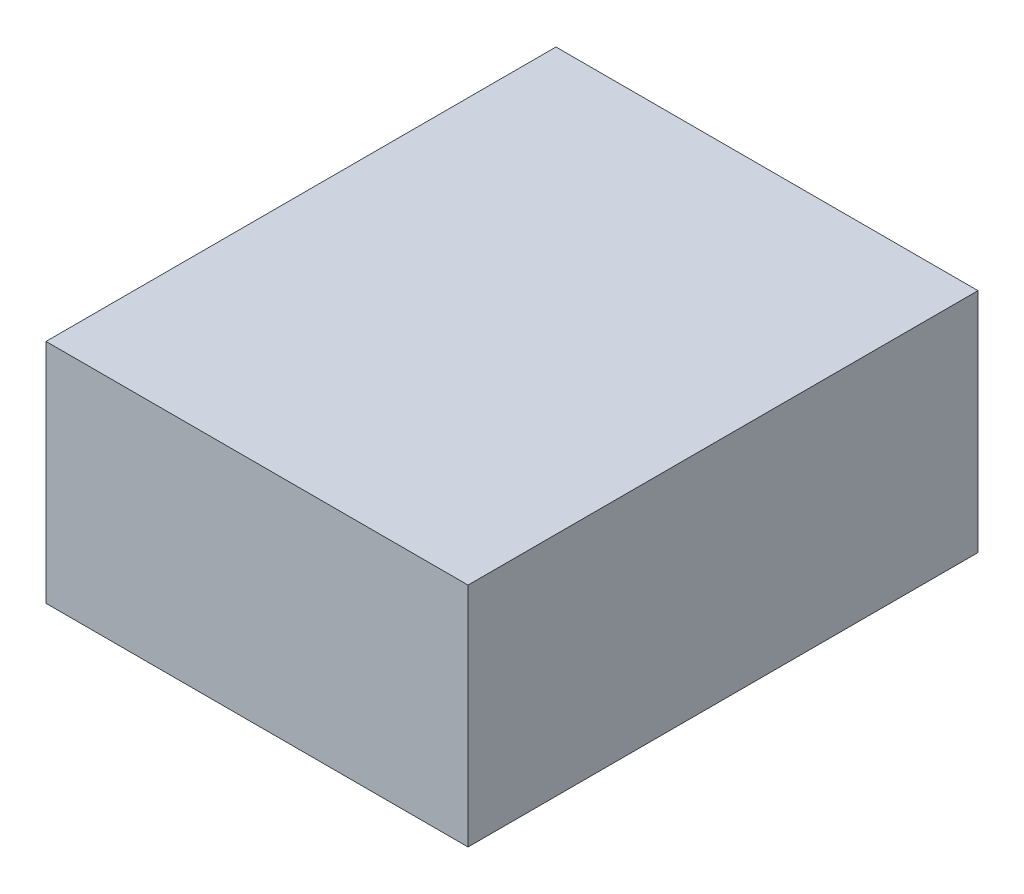
ISO-10303-21;
HEADER;
FILE_DESCRIPTION(('STEP AP214'),'2;1');
FILE_NAME('part.step','',(''),(''),'','','');
FILE_SCHEMA(('AUTOMOTIVE_DESIGN { 1 0 10303 214 1 1 1 1 }'));
ENDSEC;
DATA;
#1=APPLICATION_CONTEXT('core data for automotive mechanical design processes');
#2=APPLICATION_PROTOCOL_DEFINITION('international standard','automotive_design',2000,#1);
#3=PRODUCT_CONTEXT('',#1,'mechanical');
#4=PRODUCT('Part','Part','',(#3));
#5=PRODUCT_RELATED_PRODUCT_CATEGORY('part','',(#4));
#6=PRODUCT_DEFINITION_FORMATION('','',#4);
#7=PRODUCT_DEFINITION_CONTEXT('part definition',#1,'design');
#8=PRODUCT_DEFINITION('design','',#6,#7);
#9=PRODUCT_DEFINITION_SHAPE('','',#8);
#10=(LENGTH_UNIT() NAMED_UNIT(*) SI_UNIT(.MILLI.,.METRE.));
#11=(NAMED_UNIT(*) PLANE_ANGLE_UNIT() SI_UNIT($,.RADIAN.));
#12=(NAMED_UNIT(*) SI_UNIT($,.STERADIAN.) SOLID_ANGLE_UNIT());
#13=UNCERTAINTY_MEASURE_WITH_UNIT(LENGTH_MEASURE(1.E-05),#10,'distance_accuracy_value','');
#14=(GEOMETRIC_REPRESENTATION_CONTEXT(3) GLOBAL_UNCERTAINTY_ASSIGNED_CONTEXT((#13)) GLOBAL_UNIT_ASSIGNED_CONTEXT((#10,
#11,#12)) REPRESENTATION_CONTEXT('',''));
#15=CARTESIAN_POINT('',(0.,0.,0.));
#16=DIRECTION('',(0.,0.,1.));
#17=DIRECTION('',(1.,0.,0.));
#18=AXIS2_PLACEMENT_3D('',#15,#16,#17);
#19=CARTESIAN_POINT('',(120.,-64.5,290.));
#20=DIRECTION('',(0.,-1.,0.));
#21=DIRECTION('',(1.,0.,0.));
#22=AXIS2_PLACEMENT_3D('',#19,#20,#21);
#23=PLANE('',#22);
#24=DIRECTION('',(-1.,0.,0.));
#25=VECTOR('',#24,1.);
#26=CARTESIAN_POINT('',(120.,-64.5,0.));
#27=LINE('',#26,#25);
#28=CARTESIAN_POINT('',(120.,-64.5,0.));
#29=VERTEX_POINT('',#28);
#30=CARTESIAN_POINT('',(-120.,-64.5,0.));
#31=VERTEX_POINT('',#30);
#32=EDGE_CURVE('E112',#29,#31,#27,.T.);
#33=ORIENTED_EDGE('',*,*,#32,.F.);
#34=DIRECTION('',(0.,0.,-1.));
#35=VECTOR('',#34,1.);
#36=CARTESIAN_POINT('',(120.,-64.5,290.));
#37=LINE('',#36,#35);
#38=CARTESIAN_POINT('',(120.,-64.5,290.));
#39=VERTEX_POINT('',#38);
#40=EDGE_CURVE('E11',#39,#29,#37,.T.);
#41=ORIENTED_EDGE('',*,*,#40,.F.);
#42=DIRECTION('',(-1.,0.,0.));
#43=VECTOR('',#42,1.);
#44=CARTESIAN_POINT('',(120.,-64.5,290.));
#45=LINE('',#44,#43);
#46=CARTESIAN_POINT('',(-120.,-64.5,290.));
#47=VERTEX_POINT('',#46);
#48=EDGE_CURVE('E105',#39,#47,#45,.T.);
#49=ORIENTED_EDGE('',*,*,#48,.T.);
#50=DIRECTION('',(0.,0.,-1.));
#51=VECTOR('',#50,1.);
#52=CARTESIAN_POINT('',(-120.,-64.5,290.));
#53=LINE('',#52,#51);
#54=EDGE_CURVE('E44',#47,#31,#53,.T.);
#55=ORIENTED_EDGE('',*,*,#54,.T.);
#56=EDGE_LOOP('',(#33,#41,#49,#55));
#57=FACE_BOUND('',#56,.T.);
#58=ADVANCED_FACE('F41',(#57),#23,.T.);
#59=CARTESIAN_POINT('',(120.,-64.5,290.));
#60=DIRECTION('',(-1.,0.,0.));
#61=DIRECTION('',(0.,0.,1.));
#62=AXIS2_PLACEMENT_3D('',#59,#60,#61);
#63=PLANE('',#62);
#64=DIRECTION('',(0.,1.,0.));
#65=VECTOR('',#64,1.);
#66=CARTESIAN_POINT('',(120.,-64.5,0.));
#67=LINE('',#66,#65);
#68=CARTESIAN_POINT('',(120.,64.5,0.));
#69=VERTEX_POINT('',#68);
#70=EDGE_CURVE('E75',#29,#69,#67,.T.);
#71=ORIENTED_EDGE('',*,*,#70,.T.);
#72=DIRECTION('',(0.,0.,-1.));
#73=VECTOR('',#72,1.);
#74=CARTESIAN_POINT('',(120.,64.5,290.));
#75=LINE('',#74,#73);
#76=CARTESIAN_POINT('',(120.,64.5,290.));
#77=VERTEX_POINT('',#76);
#78=EDGE_CURVE('E51',#77,#69,#75,.T.);
#79=ORIENTED_EDGE('',*,*,#78,.F.);
#80=DIRECTION('',(0.,1.,0.));
#81=VECTOR('',#80,1.);
#82=CARTESIAN_POINT('',(120.,-64.5,290.));
#83=LINE('',#82,#81);
#84=EDGE_CURVE('E92',#39,#77,#83,.T.);
#85=ORIENTED_EDGE('',*,*,#84,.F.);
#86=ORIENTED_EDGE('',*,*,#40,.T.);
#87=EDGE_LOOP('',(#71,#79,#85,#86));
#88=FACE_BOUND('',#87,.T.);
#89=ADVANCED_FACE('F128',(#88),#63,.F.);
#90=CARTESIAN_POINT('',(120.,64.5,290.));
#91=DIRECTION('',(0.,-1.,0.));
#92=DIRECTION('',(1.,0.,0.));
#93=AXIS2_PLACEMENT_3D('',#90,#91,#92);
#94=PLANE('',#93);
#95=DIRECTION('',(-1.,0.,0.));
#96=VECTOR('',#95,1.);
#97=CARTESIAN_POINT('',(120.,64.5,0.));
#98=LINE('',#97,#96);
#99=CARTESIAN_POINT('',(-120.,64.5,0.));
#100=VERTEX_POINT('',#99);
#101=EDGE_CURVE('E100',#69,#100,#98,.T.);
#102=ORIENTED_EDGE('',*,*,#101,.T.);
#103=DIRECTION('',(0.,0.,-1.));
#104=VECTOR('',#103,1.);
#105=CARTESIAN_POINT('',(-120.,64.5,290.));
#106=LINE('',#105,#104);
#107=CARTESIAN_POINT('',(-120.,64.5,290.));
#108=VERTEX_POINT('',#107);
#109=EDGE_CURVE('E97',#108,#100,#106,.T.);
#110=ORIENTED_EDGE('',*,*,#109,.F.);
#111=DIRECTION('',(-1.,0.,0.));
#112=VECTOR('',#111,1.);
#113=CARTESIAN_POINT('',(120.,64.5,290.));
#114=LINE('',#113,#112);
#115=EDGE_CURVE('E87',#77,#108,#114,.T.);
#116=ORIENTED_EDGE('',*,*,#115,.F.);
#117=ORIENTED_EDGE('',*,*,#78,.T.);
#118=EDGE_LOOP('',(#102,#110,#116,#117));
#119=FACE_BOUND('',#118,.T.);
#120=ADVANCED_FACE('F98',(#119),#94,.F.);
#121=CARTESIAN_POINT('',(-120.,-64.5,290.));
#122=DIRECTION('',(-1.,0.,0.));
#123=DIRECTION('',(0.,0.,1.));
#124=AXIS2_PLACEMENT_3D('',#121,#122,#123);
#125=PLANE('',#124);
#126=DIRECTION('',(0.,1.,0.));
#127=VECTOR('',#126,1.);
#128=CARTESIAN_POINT('',(-120.,-64.5,0.));
#129=LINE('',#128,#127);
#130=EDGE_CURVE('E116',#31,#100,#129,.T.);
#131=ORIENTED_EDGE('',*,*,#130,.F.);
#132=ORIENTED_EDGE('',*,*,#54,.F.);
#133=DIRECTION('',(0.,1.,0.));
#134=VECTOR('',#133,1.);
#135=CARTESIAN_POINT('',(-120.,-64.5,290.));
#136=LINE('',#135,#134);
#137=EDGE_CURVE('E91',#47,#108,#136,.T.);
#138=ORIENTED_EDGE('',*,*,#137,.T.);
#139=ORIENTED_EDGE('',*,*,#109,.T.);
#140=EDGE_LOOP('',(#131,#132,#138,#139));
#141=FACE_BOUND('',#140,.T.);
#142=ADVANCED_FACE('F103',(#141),#125,.T.);
#143=CARTESIAN_POINT('',(0.,0.,290.));
#144=DIRECTION('',(0.,0.,-1.));
#145=DIRECTION('',(-1.,0.,0.));
#146=AXIS2_PLACEMENT_3D('',#143,#144,#145);
#147=PLANE('',#146);
#148=ORIENTED_EDGE('',*,*,#48,.F.);
#149=ORIENTED_EDGE('',*,*,#84,.T.);
#150=ORIENTED_EDGE('',*,*,#115,.T.);
#151=ORIENTED_EDGE('',*,*,#137,.F.);
#152=EDGE_LOOP('',(#148,#149,#150,#151));
#153=FACE_BOUND('',#152,.T.);
#154=ADVANCED_FACE('F90',(#153),#147,.F.);
#155=CARTESIAN_POINT('',(0.,0.,0.));
#156=DIRECTION('',(0.,0.,-1.));
#157=DIRECTION('',(-1.,0.,0.));
#158=AXIS2_PLACEMENT_3D('',#155,#156,#157);
#159=PLANE('',#158);
#160=ORIENTED_EDGE('',*,*,#32,.T.);
#161=ORIENTED_EDGE('',*,*,#130,.T.);
#162=ORIENTED_EDGE('',*,*,#101,.F.);
#163=ORIENTED_EDGE('',*,*,#70,.F.);
#164=EDGE_LOOP('',(#160,#161,#162,#163));
#165=FACE_BOUND('',#164,.T.);
#166=ADVANCED_FACE('F125',(#165),#159,.T.);
#167=CLOSED_SHELL('',(#58,#89,#120,#142,#154,#166));
#168=MANIFOLD_SOLID_BREP('B2',#167);
#169=ADVANCED_BREP_SHAPE_REPRESENTATION('',(#18,#168),#14);
#170=SHAPE_DEFINITION_REPRESENTATION(#9,#169);
ENDSEC;
END-ISO-10303-21;
